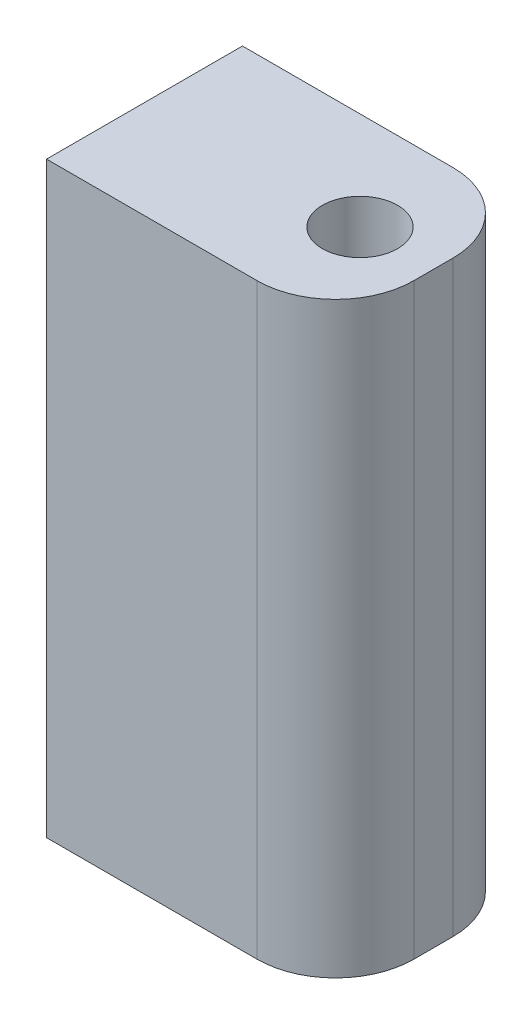
ISO-10303-21;
HEADER;
FILE_DESCRIPTION(('STEP AP214'),'2;1');
FILE_NAME('part.step','',(''),(''),'','','');
FILE_SCHEMA(('AUTOMOTIVE_DESIGN { 1 0 10303 214 1 1 1 1 }'));
ENDSEC;
DATA;
#1=APPLICATION_CONTEXT('core data for automotive mechanical design processes');
#2=APPLICATION_PROTOCOL_DEFINITION('international standard','automotive_design',2000,#1);
#3=PRODUCT_CONTEXT('',#1,'mechanical');
#4=PRODUCT('Part','Part','',(#3));
#5=PRODUCT_RELATED_PRODUCT_CATEGORY('part','',(#4));
#6=PRODUCT_DEFINITION_FORMATION('','',#4);
#7=PRODUCT_DEFINITION_CONTEXT('part definition',#1,'design');
#8=PRODUCT_DEFINITION('design','',#6,#7);
#9=PRODUCT_DEFINITION_SHAPE('','',#8);
#10=(LENGTH_UNIT() NAMED_UNIT(*) SI_UNIT(.MILLI.,.METRE.));
#11=(NAMED_UNIT(*) PLANE_ANGLE_UNIT() SI_UNIT($,.RADIAN.));
#12=(NAMED_UNIT(*) SI_UNIT($,.STERADIAN.) SOLID_ANGLE_UNIT());
#13=UNCERTAINTY_MEASURE_WITH_UNIT(LENGTH_MEASURE(1.E-05),#10,'distance_accuracy_value','');
#14=(GEOMETRIC_REPRESENTATION_CONTEXT(3) GLOBAL_UNCERTAINTY_ASSIGNED_CONTEXT((#13)) GLOBAL_UNIT_ASSIGNED_CONTEXT((#10,
#11,#12)) REPRESENTATION_CONTEXT('',''));
#15=CARTESIAN_POINT('',(0.,0.,0.));
#16=DIRECTION('',(0.,0.,1.));
#17=DIRECTION('',(1.,0.,0.));
#18=AXIS2_PLACEMENT_3D('',#15,#16,#17);
#19=CARTESIAN_POINT('',(-5.,9.525,3.175));
#20=DIRECTION('',(0.,-1.,0.));
#21=DIRECTION('',(0.,0.,-1.));
#22=AXIS2_PLACEMENT_3D('',#19,#20,#21);
#23=PLANE('',#22);
#24=CARTESIAN_POINT('',(1.985,9.525,0.));
#25=DIRECTION('',(0.,1.,0.));
#26=DIRECTION('',(0.,0.,1.));
#27=AXIS2_PLACEMENT_3D('',#24,#25,#26);
#28=CIRCLE('',#27,1.21919999999999);
#29=CARTESIAN_POINT('',(1.985,9.525,1.21919999999999));
#30=VERTEX_POINT('',#29);
#31=EDGE_CURVE('E100',#30,#30,#28,.T.);
#32=ORIENTED_EDGE('',*,*,#31,.F.);
#33=EDGE_LOOP('',(#32));
#34=FACE_BOUND('',#33,.T.);
#35=DIRECTION('',(0.,0.,-1.));
#36=VECTOR('',#35,1.);
#37=CARTESIAN_POINT('',(4.365,9.525,3.175));
#38=LINE('',#37,#36);
#39=CARTESIAN_POINT('',(4.365,9.525,0.635));
#40=VERTEX_POINT('',#39);
#41=CARTESIAN_POINT('',(4.365,9.525,-0.635));
#42=VERTEX_POINT('',#41);
#43=EDGE_CURVE('E107',#40,#42,#38,.T.);
#44=ORIENTED_EDGE('',*,*,#43,.T.);
#45=CARTESIAN_POINT('',(1.825,9.525,-0.635));
#46=DIRECTION('',(0.,-1.,0.));
#47=DIRECTION('',(0.,0.,-1.));
#48=AXIS2_PLACEMENT_3D('',#45,#46,#47);
#49=CIRCLE('',#48,2.54);
#50=CARTESIAN_POINT('',(1.825,9.525,-3.175));
#51=VERTEX_POINT('',#50);
#52=EDGE_CURVE('E139',#42,#51,#49,.F.);
#53=ORIENTED_EDGE('',*,*,#52,.T.);
#54=DIRECTION('',(-1.,0.,0.));
#55=VECTOR('',#54,1.);
#56=CARTESIAN_POINT('',(-5.,9.525,-3.175));
#57=LINE('',#56,#55);
#58=CARTESIAN_POINT('',(-5.,9.525,-3.175));
#59=VERTEX_POINT('',#58);
#60=EDGE_CURVE('E113',#51,#59,#57,.T.);
#61=ORIENTED_EDGE('',*,*,#60,.T.);
#62=DIRECTION('',(0.,0.,-1.));
#63=VECTOR('',#62,1.);
#64=CARTESIAN_POINT('',(-5.,9.525,3.175));
#65=LINE('',#64,#63);
#66=CARTESIAN_POINT('',(-5.,9.525,3.175));
#67=VERTEX_POINT('',#66);
#68=EDGE_CURVE('E128',#67,#59,#65,.T.);
#69=ORIENTED_EDGE('',*,*,#68,.F.);
#70=DIRECTION('',(-1.,0.,0.));
#71=VECTOR('',#70,1.);
#72=CARTESIAN_POINT('',(-5.,9.525,3.175));
#73=LINE('',#72,#71);
#74=CARTESIAN_POINT('',(1.825,9.525,3.175));
#75=VERTEX_POINT('',#74);
#76=EDGE_CURVE('E114',#75,#67,#73,.T.);
#77=ORIENTED_EDGE('',*,*,#76,.F.);
#78=CARTESIAN_POINT('',(1.825,9.525,0.635));
#79=DIRECTION('',(0.,-1.,0.));
#80=DIRECTION('',(0.,0.,-1.));
#81=AXIS2_PLACEMENT_3D('',#78,#79,#80);
#82=CIRCLE('',#81,2.54);
#83=EDGE_CURVE('E137',#75,#40,#82,.F.);
#84=ORIENTED_EDGE('',*,*,#83,.T.);
#85=EDGE_LOOP('',(#44,#53,#61,#69,#77,#84));
#86=FACE_BOUND('',#85,.T.);
#87=ADVANCED_FACE('F31',(#34,#86),#23,.F.);
#88=CARTESIAN_POINT('',(-5.,9.525,3.175));
#89=DIRECTION('',(1.,0.,0.));
#90=DIRECTION('',(0.,1.,0.));
#91=AXIS2_PLACEMENT_3D('',#88,#89,#90);
#92=PLANE('',#91);
#93=CARTESIAN_POINT('',(-5.,-2.41299999999999,0.));
#94=DIRECTION('',(-1.,0.,0.));
#95=DIRECTION('',(0.,0.,1.));
#96=AXIS2_PLACEMENT_3D('',#93,#94,#95);
#97=CIRCLE('',#96,1.21919999999999);
#98=CARTESIAN_POINT('',(-5.,-2.41299999999999,1.21919999999999));
#99=VERTEX_POINT('',#98);
#100=EDGE_CURVE('E101',#99,#99,#97,.T.);
#101=ORIENTED_EDGE('',*,*,#100,.F.);
#102=EDGE_LOOP('',(#101));
#103=FACE_BOUND('',#102,.T.);
#104=DIRECTION('',(0.,-1.,0.));
#105=VECTOR('',#104,1.);
#106=CARTESIAN_POINT('',(-5.,9.525,-3.175));
#107=LINE('',#106,#105);
#108=CARTESIAN_POINT('',(-5.,-9.525,-3.175));
#109=VERTEX_POINT('',#108);
#110=EDGE_CURVE('E123',#59,#109,#107,.T.);
#111=ORIENTED_EDGE('',*,*,#110,.T.);
#112=DIRECTION('',(0.,0.,-1.));
#113=VECTOR('',#112,1.);
#114=CARTESIAN_POINT('',(-5.,-9.525,3.175));
#115=LINE('',#114,#113);
#116=CARTESIAN_POINT('',(-5.,-9.525,3.175));
#117=VERTEX_POINT('',#116);
#118=EDGE_CURVE('E121',#117,#109,#115,.T.);
#119=ORIENTED_EDGE('',*,*,#118,.F.);
#120=DIRECTION('',(0.,-1.,0.));
#121=VECTOR('',#120,1.);
#122=CARTESIAN_POINT('',(-5.,9.525,3.175));
#123=LINE('',#122,#121);
#124=EDGE_CURVE('E116',#67,#117,#123,.T.);
#125=ORIENTED_EDGE('',*,*,#124,.F.);
#126=ORIENTED_EDGE('',*,*,#68,.T.);
#127=EDGE_LOOP('',(#111,#119,#125,#126));
#128=FACE_BOUND('',#127,.T.);
#129=ADVANCED_FACE('F160',(#103,#128),#92,.F.);
#130=CARTESIAN_POINT('',(-5.,-9.525,3.175));
#131=DIRECTION('',(0.,1.,0.));
#132=DIRECTION('',(0.,0.,1.));
#133=AXIS2_PLACEMENT_3D('',#130,#131,#132);
#134=PLANE('',#133);
#135=DIRECTION('',(1.,0.,0.));
#136=VECTOR('',#135,1.);
#137=CARTESIAN_POINT('',(-5.,-9.525,-3.175));
#138=LINE('',#137,#136);
#139=CARTESIAN_POINT('',(1.825,-9.525,-3.175));
#140=VERTEX_POINT('',#139);
#141=EDGE_CURVE('E117',#109,#140,#138,.T.);
#142=ORIENTED_EDGE('',*,*,#141,.T.);
#143=CARTESIAN_POINT('',(1.825,-9.525,-0.635));
#144=DIRECTION('',(0.,1.,0.));
#145=DIRECTION('',(0.,0.,1.));
#146=AXIS2_PLACEMENT_3D('',#143,#144,#145);
#147=CIRCLE('',#146,2.54);
#148=CARTESIAN_POINT('',(4.365,-9.525,-0.635));
#149=VERTEX_POINT('',#148);
#150=EDGE_CURVE('E39',#140,#149,#147,.F.);
#151=ORIENTED_EDGE('',*,*,#150,.T.);
#152=DIRECTION('',(0.,0.,-1.));
#153=VECTOR('',#152,1.);
#154=CARTESIAN_POINT('',(4.365,-9.525,3.175));
#155=LINE('',#154,#153);
#156=CARTESIAN_POINT('',(4.365,-9.525,0.635));
#157=VERTEX_POINT('',#156);
#158=EDGE_CURVE('E145',#157,#149,#155,.T.);
#159=ORIENTED_EDGE('',*,*,#158,.F.);
#160=CARTESIAN_POINT('',(1.825,-9.525,0.635));
#161=DIRECTION('',(0.,1.,0.));
#162=DIRECTION('',(0.,0.,1.));
#163=AXIS2_PLACEMENT_3D('',#160,#161,#162);
#164=CIRCLE('',#163,2.54);
#165=CARTESIAN_POINT('',(1.825,-9.525,3.175));
#166=VERTEX_POINT('',#165);
#167=EDGE_CURVE('E46',#157,#166,#164,.F.);
#168=ORIENTED_EDGE('',*,*,#167,.T.);
#169=DIRECTION('',(1.,0.,0.));
#170=VECTOR('',#169,1.);
#171=CARTESIAN_POINT('',(-5.,-9.525,3.175));
#172=LINE('',#171,#170);
#173=EDGE_CURVE('E119',#117,#166,#172,.T.);
#174=ORIENTED_EDGE('',*,*,#173,.F.);
#175=ORIENTED_EDGE('',*,*,#118,.T.);
#176=EDGE_LOOP('',(#142,#151,#159,#168,#174,#175));
#177=FACE_BOUND('',#176,.T.);
#178=ADVANCED_FACE('F144',(#177),#134,.F.);
#179=CARTESIAN_POINT('',(5.,-9.525,3.175));
#180=DIRECTION('',(0.,0.,1.));
#181=DIRECTION('',(1.,0.,0.));
#182=AXIS2_PLACEMENT_3D('',#179,#180,#181);
#183=PLANE('',#182);
#184=ORIENTED_EDGE('',*,*,#173,.T.);
#185=DIRECTION('',(0.,-1.,0.));
#186=VECTOR('',#185,1.);
#187=CARTESIAN_POINT('',(1.825,9.525,3.175));
#188=LINE('',#187,#186);
#189=EDGE_CURVE('E11',#166,#75,#188,.F.);
#190=ORIENTED_EDGE('',*,*,#189,.T.);
#191=ORIENTED_EDGE('',*,*,#76,.T.);
#192=ORIENTED_EDGE('',*,*,#124,.T.);
#193=EDGE_LOOP('',(#184,#190,#191,#192));
#194=FACE_BOUND('',#193,.T.);
#195=ADVANCED_FACE('F164',(#194),#183,.T.);
#196=CARTESIAN_POINT('',(5.,-9.525,-3.175));
#197=DIRECTION('',(0.,0.,1.));
#198=DIRECTION('',(1.,0.,0.));
#199=AXIS2_PLACEMENT_3D('',#196,#197,#198);
#200=PLANE('',#199);
#201=ORIENTED_EDGE('',*,*,#60,.F.);
#202=DIRECTION('',(0.,1.,0.));
#203=VECTOR('',#202,1.);
#204=CARTESIAN_POINT('',(1.825,-9.525,-3.175));
#205=LINE('',#204,#203);
#206=EDGE_CURVE('E54',#51,#140,#205,.F.);
#207=ORIENTED_EDGE('',*,*,#206,.T.);
#208=ORIENTED_EDGE('',*,*,#141,.F.);
#209=ORIENTED_EDGE('',*,*,#110,.F.);
#210=EDGE_LOOP('',(#201,#207,#208,#209));
#211=FACE_BOUND('',#210,.T.);
#212=ADVANCED_FACE('F157',(#211),#200,.F.);
#213=CARTESIAN_POINT('',(1.985,3.175,0.));
#214=DIRECTION('',(0.,1.,0.));
#215=DIRECTION('',(0.,0.,1.));
#216=AXIS2_PLACEMENT_3D('',#213,#214,#215);
#217=CONICAL_SURFACE('',#216,1.2192,1.02974425867665);
#218=CARTESIAN_POINT('',(1.985,2.4424307332816,0.));
#219=VERTEX_POINT('',#218);
#220=VERTEX_LOOP('',#219);
#221=FACE_BOUND('',#220,.T.);
#222=CARTESIAN_POINT('',(1.985,3.175,0.));
#223=DIRECTION('',(0.,1.,0.));
#224=DIRECTION('',(0.,0.,1.));
#225=AXIS2_PLACEMENT_3D('',#222,#223,#224);
#226=CIRCLE('',#225,1.2192);
#227=CARTESIAN_POINT('',(1.985,3.175,1.2192));
#228=VERTEX_POINT('',#227);
#229=EDGE_CURVE('E104',#228,#228,#226,.T.);
#230=ORIENTED_EDGE('',*,*,#229,.T.);
#231=EDGE_LOOP('',(#230));
#232=FACE_BOUND('',#231,.T.);
#233=ADVANCED_FACE('F188',(#221,#232),#217,.F.);
#234=CARTESIAN_POINT('',(1.985,9.525,0.));
#235=DIRECTION('',(0.,1.,0.));
#236=DIRECTION('',(0.,0.,1.));
#237=AXIS2_PLACEMENT_3D('',#234,#235,#236);
#238=CYLINDRICAL_SURFACE('',#237,1.21919999999999);
#239=ORIENTED_EDGE('',*,*,#229,.F.);
#240=EDGE_LOOP('',(#239));
#241=FACE_BOUND('',#240,.T.);
#242=ORIENTED_EDGE('',*,*,#31,.T.);
#243=EDGE_LOOP('',(#242));
#244=FACE_BOUND('',#243,.T.);
#245=ADVANCED_FACE('F94',(#241,#244),#238,.F.);
#246=CARTESIAN_POINT('',(1.35,-2.41299999999999,0.));
#247=DIRECTION('',(-1.,0.,0.));
#248=DIRECTION('',(0.,0.,1.));
#249=AXIS2_PLACEMENT_3D('',#246,#247,#248);
#250=CONICAL_SURFACE('',#249,1.2192,1.02974425867665);
#251=CARTESIAN_POINT('',(2.0825692667184,-2.41299999999999,0.));
#252=VERTEX_POINT('',#251);
#253=VERTEX_LOOP('',#252);
#254=FACE_BOUND('',#253,.T.);
#255=CARTESIAN_POINT('',(1.35,-2.41299999999999,0.));
#256=DIRECTION('',(-1.,0.,0.));
#257=DIRECTION('',(0.,0.,1.));
#258=AXIS2_PLACEMENT_3D('',#255,#256,#257);
#259=CIRCLE('',#258,1.2192);
#260=CARTESIAN_POINT('',(1.35,-2.41299999999999,1.2192));
#261=VERTEX_POINT('',#260);
#262=EDGE_CURVE('E98',#261,#261,#259,.T.);
#263=ORIENTED_EDGE('',*,*,#262,.T.);
#264=EDGE_LOOP('',(#263));
#265=FACE_BOUND('',#264,.T.);
#266=ADVANCED_FACE('F90',(#254,#265),#250,.F.);
#267=CARTESIAN_POINT('',(-5.,-2.41299999999999,0.));
#268=DIRECTION('',(-1.,0.,0.));
#269=DIRECTION('',(0.,0.,1.));
#270=AXIS2_PLACEMENT_3D('',#267,#268,#269);
#271=CYLINDRICAL_SURFACE('',#270,1.21919999999999);
#272=ORIENTED_EDGE('',*,*,#262,.F.);
#273=EDGE_LOOP('',(#272));
#274=FACE_BOUND('',#273,.T.);
#275=ORIENTED_EDGE('',*,*,#100,.T.);
#276=EDGE_LOOP('',(#275));
#277=FACE_BOUND('',#276,.T.);
#278=ADVANCED_FACE('F93',(#274,#277),#271,.F.);
#279=CARTESIAN_POINT('',(4.365,9.525,3.175));
#280=DIRECTION('',(-1.,0.,0.));
#281=DIRECTION('',(0.,0.,1.));
#282=AXIS2_PLACEMENT_3D('',#279,#280,#281);
#283=PLANE('',#282);
#284=ORIENTED_EDGE('',*,*,#158,.T.);
#285=DIRECTION('',(0.,1.,0.));
#286=VECTOR('',#285,1.);
#287=CARTESIAN_POINT('',(4.365,9.525,-0.635));
#288=LINE('',#287,#286);
#289=EDGE_CURVE('E134',#149,#42,#288,.T.);
#290=ORIENTED_EDGE('',*,*,#289,.T.);
#291=ORIENTED_EDGE('',*,*,#43,.F.);
#292=DIRECTION('',(0.,-1.,0.));
#293=VECTOR('',#292,1.);
#294=CARTESIAN_POINT('',(4.365,9.525,0.635));
#295=LINE('',#294,#293);
#296=EDGE_CURVE('E131',#40,#157,#295,.T.);
#297=ORIENTED_EDGE('',*,*,#296,.T.);
#298=EDGE_LOOP('',(#284,#290,#291,#297));
#299=FACE_BOUND('',#298,.T.);
#300=ADVANCED_FACE('F149',(#299),#283,.F.);
#301=CARTESIAN_POINT('',(1.825,9.525,-0.635));
#302=DIRECTION('',(0.,1.,0.));
#303=DIRECTION('',(0.,0.,1.));
#304=AXIS2_PLACEMENT_3D('',#301,#302,#303);
#305=CYLINDRICAL_SURFACE('',#304,2.54);
#306=ORIENTED_EDGE('',*,*,#150,.F.);
#307=ORIENTED_EDGE('',*,*,#206,.F.);
#308=ORIENTED_EDGE('',*,*,#52,.F.);
#309=ORIENTED_EDGE('',*,*,#289,.F.);
#310=EDGE_LOOP('',(#306,#307,#308,#309));
#311=FACE_BOUND('',#310,.T.);
#312=ADVANCED_FACE('F153',(#311),#305,.T.);
#313=CARTESIAN_POINT('',(1.825,9.525,0.635));
#314=DIRECTION('',(0.,1.,0.));
#315=DIRECTION('',(0.,0.,1.));
#316=AXIS2_PLACEMENT_3D('',#313,#314,#315);
#317=CYLINDRICAL_SURFACE('',#316,2.54);
#318=ORIENTED_EDGE('',*,*,#83,.F.);
#319=ORIENTED_EDGE('',*,*,#189,.F.);
#320=ORIENTED_EDGE('',*,*,#167,.F.);
#321=ORIENTED_EDGE('',*,*,#296,.F.);
#322=EDGE_LOOP('',(#318,#319,#320,#321));
#323=FACE_BOUND('',#322,.T.);
#324=ADVANCED_FACE('F33',(#323),#317,.T.);
#325=CLOSED_SHELL('',(#87,#129,#178,#195,#212,#233,#245,#266,#278,#300,#312,#324));
#326=MANIFOLD_SOLID_BREP('B2',#325);
#327=ADVANCED_BREP_SHAPE_REPRESENTATION('',(#18,#326),#14);
#328=SHAPE_DEFINITION_REPRESENTATION(#9,#327);
ENDSEC;
END-ISO-10303-21;
